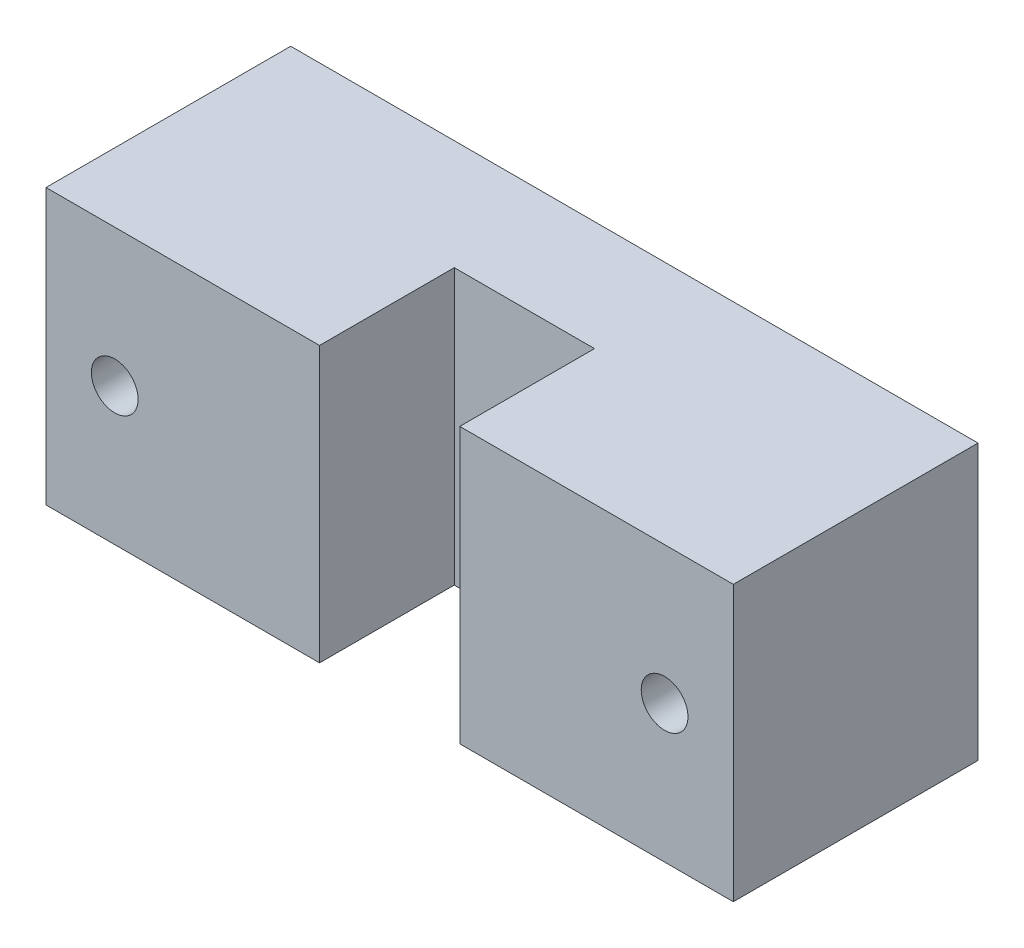
ISO-10303-21;
HEADER;
FILE_DESCRIPTION(('STEP AP214'),'2;1');
FILE_NAME('part.step','',(''),(''),'','','');
FILE_SCHEMA(('AUTOMOTIVE_DESIGN { 1 0 10303 214 1 1 1 1 }'));
ENDSEC;
DATA;
#1=APPLICATION_CONTEXT('core data for automotive mechanical design processes');
#2=APPLICATION_PROTOCOL_DEFINITION('international standard','automotive_design',2000,#1);
#3=PRODUCT_CONTEXT('',#1,'mechanical');
#4=PRODUCT('Part','Part','',(#3));
#5=PRODUCT_RELATED_PRODUCT_CATEGORY('part','',(#4));
#6=PRODUCT_DEFINITION_FORMATION('','',#4);
#7=PRODUCT_DEFINITION_CONTEXT('part definition',#1,'design');
#8=PRODUCT_DEFINITION('design','',#6,#7);
#9=PRODUCT_DEFINITION_SHAPE('','',#8);
#10=(LENGTH_UNIT() NAMED_UNIT(*) SI_UNIT(.MILLI.,.METRE.));
#11=(NAMED_UNIT(*) PLANE_ANGLE_UNIT() SI_UNIT($,.RADIAN.));
#12=(NAMED_UNIT(*) SI_UNIT($,.STERADIAN.) SOLID_ANGLE_UNIT());
#13=UNCERTAINTY_MEASURE_WITH_UNIT(LENGTH_MEASURE(1.E-05),#10,'distance_accuracy_value','');
#14=(GEOMETRIC_REPRESENTATION_CONTEXT(3) GLOBAL_UNCERTAINTY_ASSIGNED_CONTEXT((#13)) GLOBAL_UNIT_ASSIGNED_CONTEXT((#10,
#11,#12)) REPRESENTATION_CONTEXT('',''));
#15=CARTESIAN_POINT('',(0.,0.,0.));
#16=DIRECTION('',(0.,0.,1.));
#17=DIRECTION('',(1.,0.,0.));
#18=AXIS2_PLACEMENT_3D('',#15,#16,#17);
#19=CARTESIAN_POINT('',(0.,0.,8.));
#20=DIRECTION('',(0.,0.,1.));
#21=DIRECTION('',(1.,0.,0.));
#22=AXIS2_PLACEMENT_3D('',#19,#20,#21);
#23=PLANE('',#22);
#24=DIRECTION('',(0.,-1.,0.));
#25=VECTOR('',#24,1.);
#26=CARTESIAN_POINT('',(-5.1,63.0739107283418,8.));
#27=LINE('',#26,#25);
#28=CARTESIAN_POINT('',(-5.1,10.,8.));
#29=VERTEX_POINT('',#28);
#30=CARTESIAN_POINT('',(-5.1,-9.99999999999999,8.));
#31=VERTEX_POINT('',#30);
#32=EDGE_CURVE('E61',#29,#31,#27,.T.);
#33=ORIENTED_EDGE('',*,*,#32,.T.);
#34=DIRECTION('',(1.,0.,0.));
#35=VECTOR('',#34,1.);
#36=CARTESIAN_POINT('',(25.,-9.99999999999999,8.));
#37=LINE('',#36,#35);
#38=CARTESIAN_POINT('',(5.1,-9.99999999999999,8.));
#39=VERTEX_POINT('',#38);
#40=EDGE_CURVE('E56',#31,#39,#37,.T.);
#41=ORIENTED_EDGE('',*,*,#40,.T.);
#42=DIRECTION('',(0.,-1.,0.));
#43=VECTOR('',#42,1.);
#44=CARTESIAN_POINT('',(5.1,63.0739107283418,8.));
#45=LINE('',#44,#43);
#46=CARTESIAN_POINT('',(5.1,10.,8.));
#47=VERTEX_POINT('',#46);
#48=EDGE_CURVE('E149',#47,#39,#45,.T.);
#49=ORIENTED_EDGE('',*,*,#48,.F.);
#50=DIRECTION('',(-1.,0.,0.));
#51=VECTOR('',#50,1.);
#52=CARTESIAN_POINT('',(25.,10.,8.));
#53=LINE('',#52,#51);
#54=EDGE_CURVE('E153',#47,#29,#53,.T.);
#55=ORIENTED_EDGE('',*,*,#54,.T.);
#56=EDGE_LOOP('',(#33,#41,#49,#55));
#57=FACE_BOUND('',#56,.T.);
#58=ADVANCED_FACE('F39',(#57),#23,.T.);
#59=CARTESIAN_POINT('',(0.,0.,0.));
#60=DIRECTION('',(0.,0.,1.));
#61=DIRECTION('',(1.,0.,0.));
#62=AXIS2_PLACEMENT_3D('',#59,#60,#61);
#63=PLANE('',#62);
#64=CARTESIAN_POINT('',(20.,0.,0.));
#65=DIRECTION('',(0.,0.,-1.));
#66=DIRECTION('',(-1.,0.,0.));
#67=AXIS2_PLACEMENT_3D('',#64,#65,#66);
#68=CIRCLE('',#67,3.75);
#69=CARTESIAN_POINT('',(16.25,0.,0.));
#70=VERTEX_POINT('',#69);
#71=EDGE_CURVE('E192',#70,#70,#68,.T.);
#72=ORIENTED_EDGE('',*,*,#71,.F.);
#73=EDGE_LOOP('',(#72));
#74=FACE_BOUND('',#73,.T.);
#75=CARTESIAN_POINT('',(-20.,0.,0.));
#76=DIRECTION('',(0.,0.,-1.));
#77=DIRECTION('',(-1.,0.,0.));
#78=AXIS2_PLACEMENT_3D('',#75,#76,#77);
#79=CIRCLE('',#78,3.75);
#80=CARTESIAN_POINT('',(-23.75,0.,0.));
#81=VERTEX_POINT('',#80);
#82=EDGE_CURVE('E187',#81,#81,#79,.T.);
#83=ORIENTED_EDGE('',*,*,#82,.F.);
#84=EDGE_LOOP('',(#83));
#85=FACE_BOUND('',#84,.T.);
#86=DIRECTION('',(0.,-1.,0.));
#87=VECTOR('',#86,1.);
#88=CARTESIAN_POINT('',(-25.,-9.99999999999999,0.));
#89=LINE('',#88,#87);
#90=CARTESIAN_POINT('',(-25.,10.,0.));
#91=VERTEX_POINT('',#90);
#92=CARTESIAN_POINT('',(-25.,-9.99999999999999,0.));
#93=VERTEX_POINT('',#92);
#94=EDGE_CURVE('E157',#91,#93,#89,.T.);
#95=ORIENTED_EDGE('',*,*,#94,.F.);
#96=DIRECTION('',(-1.,0.,0.));
#97=VECTOR('',#96,1.);
#98=CARTESIAN_POINT('',(25.,10.,0.));
#99=LINE('',#98,#97);
#100=CARTESIAN_POINT('',(25.,10.,0.));
#101=VERTEX_POINT('',#100);
#102=EDGE_CURVE('E154',#101,#91,#99,.T.);
#103=ORIENTED_EDGE('',*,*,#102,.F.);
#104=DIRECTION('',(0.,1.,0.));
#105=VECTOR('',#104,1.);
#106=CARTESIAN_POINT('',(25.,-9.99999999999999,0.));
#107=LINE('',#106,#105);
#108=CARTESIAN_POINT('',(25.,-9.99999999999999,0.));
#109=VERTEX_POINT('',#108);
#110=EDGE_CURVE('E161',#109,#101,#107,.T.);
#111=ORIENTED_EDGE('',*,*,#110,.F.);
#112=DIRECTION('',(1.,0.,0.));
#113=VECTOR('',#112,1.);
#114=CARTESIAN_POINT('',(25.,-9.99999999999999,0.));
#115=LINE('',#114,#113);
#116=EDGE_CURVE('E109',#93,#109,#115,.T.);
#117=ORIENTED_EDGE('',*,*,#116,.F.);
#118=EDGE_LOOP('',(#95,#103,#111,#117));
#119=FACE_BOUND('',#118,.T.);
#120=ADVANCED_FACE('F171',(#74,#85,#119),#63,.F.);
#121=CARTESIAN_POINT('',(-25.,-9.99999999999999,8.));
#122=DIRECTION('',(1.,0.,0.));
#123=DIRECTION('',(0.,1.,0.));
#124=AXIS2_PLACEMENT_3D('',#121,#122,#123);
#125=PLANE('',#124);
#126=ORIENTED_EDGE('',*,*,#94,.T.);
#127=DIRECTION('',(0.,0.,-1.));
#128=VECTOR('',#127,1.);
#129=CARTESIAN_POINT('',(-25.,-9.99999999999999,8.));
#130=LINE('',#129,#128);
#131=CARTESIAN_POINT('',(-25.,-9.99999999999999,17.8));
#132=VERTEX_POINT('',#131);
#133=EDGE_CURVE('E11',#132,#93,#130,.T.);
#134=ORIENTED_EDGE('',*,*,#133,.F.);
#135=DIRECTION('',(0.,-1.,0.));
#136=VECTOR('',#135,1.);
#137=CARTESIAN_POINT('',(-25.,63.0739107283418,17.8));
#138=LINE('',#137,#136);
#139=CARTESIAN_POINT('',(-25.,10.,17.8));
#140=VERTEX_POINT('',#139);
#141=EDGE_CURVE('E142',#140,#132,#138,.T.);
#142=ORIENTED_EDGE('',*,*,#141,.F.);
#143=DIRECTION('',(0.,0.,-1.));
#144=VECTOR('',#143,1.);
#145=CARTESIAN_POINT('',(-25.,10.,8.));
#146=LINE('',#145,#144);
#147=EDGE_CURVE('E156',#140,#91,#146,.T.);
#148=ORIENTED_EDGE('',*,*,#147,.T.);
#149=EDGE_LOOP('',(#126,#134,#142,#148));
#150=FACE_BOUND('',#149,.T.);
#151=ADVANCED_FACE('F41',(#150),#125,.F.);
#152=CARTESIAN_POINT('',(25.,-9.99999999999999,8.));
#153=DIRECTION('',(0.,1.,0.));
#154=DIRECTION('',(-1.,0.,0.));
#155=AXIS2_PLACEMENT_3D('',#152,#153,#154);
#156=PLANE('',#155);
#157=ORIENTED_EDGE('',*,*,#116,.T.);
#158=DIRECTION('',(0.,0.,-1.));
#159=VECTOR('',#158,1.);
#160=CARTESIAN_POINT('',(25.,-9.99999999999999,8.));
#161=LINE('',#160,#159);
#162=CARTESIAN_POINT('',(25.,-9.99999999999999,17.8));
#163=VERTEX_POINT('',#162);
#164=EDGE_CURVE('E48',#163,#109,#161,.T.);
#165=ORIENTED_EDGE('',*,*,#164,.F.);
#166=DIRECTION('',(-1.,0.,0.));
#167=VECTOR('',#166,1.);
#168=CARTESIAN_POINT('',(5.1,-9.99999999999999,17.8));
#169=LINE('',#168,#167);
#170=CARTESIAN_POINT('',(5.1,-9.99999999999999,17.8));
#171=VERTEX_POINT('',#170);
#172=EDGE_CURVE('E108',#163,#171,#169,.T.);
#173=ORIENTED_EDGE('',*,*,#172,.T.);
#174=DIRECTION('',(0.,0.,-1.));
#175=VECTOR('',#174,1.);
#176=CARTESIAN_POINT('',(5.1,-9.99999999999999,8.));
#177=LINE('',#176,#175);
#178=EDGE_CURVE('E127',#171,#39,#177,.T.);
#179=ORIENTED_EDGE('',*,*,#178,.T.);
#180=ORIENTED_EDGE('',*,*,#40,.F.);
#181=DIRECTION('',(0.,0.,1.));
#182=VECTOR('',#181,1.);
#183=CARTESIAN_POINT('',(-5.1,-9.99999999999999,17.8));
#184=LINE('',#183,#182);
#185=CARTESIAN_POINT('',(-5.1,-9.99999999999999,17.8));
#186=VERTEX_POINT('',#185);
#187=EDGE_CURVE('E130',#31,#186,#184,.T.);
#188=ORIENTED_EDGE('',*,*,#187,.T.);
#189=DIRECTION('',(-1.,0.,0.));
#190=VECTOR('',#189,1.);
#191=CARTESIAN_POINT('',(-25.,-9.99999999999999,17.8));
#192=LINE('',#191,#190);
#193=EDGE_CURVE('E122',#186,#132,#192,.T.);
#194=ORIENTED_EDGE('',*,*,#193,.T.);
#195=ORIENTED_EDGE('',*,*,#133,.T.);
#196=EDGE_LOOP('',(#157,#165,#173,#179,#180,#188,#194,#195));
#197=FACE_BOUND('',#196,.T.);
#198=ADVANCED_FACE('F105',(#197),#156,.F.);
#199=CARTESIAN_POINT('',(25.,-9.99999999999999,8.));
#200=DIRECTION('',(-1.,0.,0.));
#201=DIRECTION('',(0.,-1.,0.));
#202=AXIS2_PLACEMENT_3D('',#199,#200,#201);
#203=PLANE('',#202);
#204=ORIENTED_EDGE('',*,*,#110,.T.);
#205=DIRECTION('',(0.,0.,-1.));
#206=VECTOR('',#205,1.);
#207=CARTESIAN_POINT('',(25.,10.,8.));
#208=LINE('',#207,#206);
#209=CARTESIAN_POINT('',(25.,10.,17.8));
#210=VERTEX_POINT('',#209);
#211=EDGE_CURVE('E112',#210,#101,#208,.T.);
#212=ORIENTED_EDGE('',*,*,#211,.F.);
#213=DIRECTION('',(0.,-1.,0.));
#214=VECTOR('',#213,1.);
#215=CARTESIAN_POINT('',(25.,63.0739107283418,17.8));
#216=LINE('',#215,#214);
#217=EDGE_CURVE('E115',#210,#163,#216,.T.);
#218=ORIENTED_EDGE('',*,*,#217,.T.);
#219=ORIENTED_EDGE('',*,*,#164,.T.);
#220=EDGE_LOOP('',(#204,#212,#218,#219));
#221=FACE_BOUND('',#220,.T.);
#222=ADVANCED_FACE('F116',(#221),#203,.F.);
#223=CARTESIAN_POINT('',(25.,10.,8.));
#224=DIRECTION('',(0.,-1.,0.));
#225=DIRECTION('',(1.,0.,0.));
#226=AXIS2_PLACEMENT_3D('',#223,#224,#225);
#227=PLANE('',#226);
#228=ORIENTED_EDGE('',*,*,#102,.T.);
#229=ORIENTED_EDGE('',*,*,#147,.F.);
#230=DIRECTION('',(1.,0.,0.));
#231=VECTOR('',#230,1.);
#232=CARTESIAN_POINT('',(-25.,10.,17.8));
#233=LINE('',#232,#231);
#234=CARTESIAN_POINT('',(-5.1,10.,17.8));
#235=VERTEX_POINT('',#234);
#236=EDGE_CURVE('E135',#140,#235,#233,.T.);
#237=ORIENTED_EDGE('',*,*,#236,.T.);
#238=DIRECTION('',(0.,0.,-1.));
#239=VECTOR('',#238,1.);
#240=CARTESIAN_POINT('',(-5.1,10.,17.8));
#241=LINE('',#240,#239);
#242=EDGE_CURVE('E181',#235,#29,#241,.T.);
#243=ORIENTED_EDGE('',*,*,#242,.T.);
#244=ORIENTED_EDGE('',*,*,#54,.F.);
#245=DIRECTION('',(0.,0.,1.));
#246=VECTOR('',#245,1.);
#247=CARTESIAN_POINT('',(5.1,10.,8.));
#248=LINE('',#247,#246);
#249=CARTESIAN_POINT('',(5.09999999999999,10.,17.8));
#250=VERTEX_POINT('',#249);
#251=EDGE_CURVE('E182',#47,#250,#248,.T.);
#252=ORIENTED_EDGE('',*,*,#251,.T.);
#253=DIRECTION('',(1.,0.,0.));
#254=VECTOR('',#253,1.);
#255=CARTESIAN_POINT('',(5.1,10.,17.8));
#256=LINE('',#255,#254);
#257=EDGE_CURVE('E145',#250,#210,#256,.T.);
#258=ORIENTED_EDGE('',*,*,#257,.T.);
#259=ORIENTED_EDGE('',*,*,#211,.T.);
#260=EDGE_LOOP('',(#228,#229,#237,#243,#244,#252,#258,#259));
#261=FACE_BOUND('',#260,.T.);
#262=ADVANCED_FACE('F168',(#261),#227,.F.);
#263=CARTESIAN_POINT('',(5.09999999999999,63.0739107283418,17.8));
#264=DIRECTION('',(0.,0.,1.));
#265=DIRECTION('',(1.,0.,0.));
#266=AXIS2_PLACEMENT_3D('',#263,#264,#265);
#267=PLANE('',#266);
#268=CARTESIAN_POINT('',(20.,0.,17.8));
#269=DIRECTION('',(0.,0.,-1.));
#270=DIRECTION('',(-1.,0.,0.));
#271=AXIS2_PLACEMENT_3D('',#268,#269,#270);
#272=CIRCLE('',#271,1.7);
#273=CARTESIAN_POINT('',(18.3,0.,17.8));
#274=VERTEX_POINT('',#273);
#275=EDGE_CURVE('E201',#274,#274,#272,.T.);
#276=ORIENTED_EDGE('',*,*,#275,.T.);
#277=EDGE_LOOP('',(#276));
#278=FACE_BOUND('',#277,.T.);
#279=ORIENTED_EDGE('',*,*,#257,.F.);
#280=DIRECTION('',(0.,-1.,0.));
#281=VECTOR('',#280,1.);
#282=CARTESIAN_POINT('',(5.09999999999999,63.0739107283418,17.8));
#283=LINE('',#282,#281);
#284=EDGE_CURVE('E121',#250,#171,#283,.T.);
#285=ORIENTED_EDGE('',*,*,#284,.T.);
#286=ORIENTED_EDGE('',*,*,#172,.F.);
#287=ORIENTED_EDGE('',*,*,#217,.F.);
#288=EDGE_LOOP('',(#279,#285,#286,#287));
#289=FACE_BOUND('',#288,.T.);
#290=ADVANCED_FACE('F124',(#278,#289),#267,.T.);
#291=CARTESIAN_POINT('',(5.1,63.0739107283418,8.));
#292=DIRECTION('',(-1.,0.,0.));
#293=DIRECTION('',(0.,0.,1.));
#294=AXIS2_PLACEMENT_3D('',#291,#292,#293);
#295=PLANE('',#294);
#296=ORIENTED_EDGE('',*,*,#251,.F.);
#297=ORIENTED_EDGE('',*,*,#48,.T.);
#298=ORIENTED_EDGE('',*,*,#178,.F.);
#299=ORIENTED_EDGE('',*,*,#284,.F.);
#300=EDGE_LOOP('',(#296,#297,#298,#299));
#301=FACE_BOUND('',#300,.T.);
#302=ADVANCED_FACE('F298',(#301),#295,.T.);
#303=CARTESIAN_POINT('',(-25.,63.0739107283418,17.8));
#304=DIRECTION('',(0.,0.,1.));
#305=DIRECTION('',(1.,0.,0.));
#306=AXIS2_PLACEMENT_3D('',#303,#304,#305);
#307=PLANE('',#306);
#308=CARTESIAN_POINT('',(-20.,0.,17.8));
#309=DIRECTION('',(0.,0.,-1.));
#310=DIRECTION('',(-1.,0.,0.));
#311=AXIS2_PLACEMENT_3D('',#308,#309,#310);
#312=CIRCLE('',#311,1.7);
#313=CARTESIAN_POINT('',(-21.7,0.,17.8));
#314=VERTEX_POINT('',#313);
#315=EDGE_CURVE('E196',#314,#314,#312,.T.);
#316=ORIENTED_EDGE('',*,*,#315,.T.);
#317=EDGE_LOOP('',(#316));
#318=FACE_BOUND('',#317,.T.);
#319=ORIENTED_EDGE('',*,*,#236,.F.);
#320=ORIENTED_EDGE('',*,*,#141,.T.);
#321=ORIENTED_EDGE('',*,*,#193,.F.);
#322=DIRECTION('',(0.,-1.,0.));
#323=VECTOR('',#322,1.);
#324=CARTESIAN_POINT('',(-5.1,63.0739107283418,17.8));
#325=LINE('',#324,#323);
#326=EDGE_CURVE('E146',#235,#186,#325,.T.);
#327=ORIENTED_EDGE('',*,*,#326,.F.);
#328=EDGE_LOOP('',(#319,#320,#321,#327));
#329=FACE_BOUND('',#328,.T.);
#330=ADVANCED_FACE('F179',(#318,#329),#307,.T.);
#331=CARTESIAN_POINT('',(-5.1,63.0739107283418,17.8));
#332=DIRECTION('',(1.,0.,0.));
#333=DIRECTION('',(0.,0.,-1.));
#334=AXIS2_PLACEMENT_3D('',#331,#332,#333);
#335=PLANE('',#334);
#336=ORIENTED_EDGE('',*,*,#242,.F.);
#337=ORIENTED_EDGE('',*,*,#326,.T.);
#338=ORIENTED_EDGE('',*,*,#187,.F.);
#339=ORIENTED_EDGE('',*,*,#32,.F.);
#340=EDGE_LOOP('',(#336,#337,#338,#339));
#341=FACE_BOUND('',#340,.T.);
#342=ADVANCED_FACE('F251',(#341),#335,.T.);
#343=CARTESIAN_POINT('',(-20.,0.,4.));
#344=DIRECTION('',(0.,0.,-1.));
#345=DIRECTION('',(-1.,0.,0.));
#346=AXIS2_PLACEMENT_3D('',#343,#344,#345);
#347=CYLINDRICAL_SURFACE('',#346,3.75);
#348=CARTESIAN_POINT('',(-20.,0.,4.));
#349=DIRECTION('',(0.,0.,-1.));
#350=DIRECTION('',(-1.,0.,0.));
#351=AXIS2_PLACEMENT_3D('',#348,#349,#350);
#352=CIRCLE('',#351,3.75);
#353=CARTESIAN_POINT('',(-23.75,0.,4.));
#354=VERTEX_POINT('',#353);
#355=EDGE_CURVE('E133',#354,#354,#352,.T.);
#356=ORIENTED_EDGE('',*,*,#355,.F.);
#357=EDGE_LOOP('',(#356));
#358=FACE_BOUND('',#357,.T.);
#359=ORIENTED_EDGE('',*,*,#82,.T.);
#360=EDGE_LOOP('',(#359));
#361=FACE_BOUND('',#360,.T.);
#362=ADVANCED_FACE('F256',(#358,#361),#347,.F.);
#363=CARTESIAN_POINT('',(-20.,0.,4.));
#364=DIRECTION('',(0.,0.,-1.));
#365=DIRECTION('',(-1.,0.,0.));
#366=AXIS2_PLACEMENT_3D('',#363,#364,#365);
#367=PLANE('',#366);
#368=CARTESIAN_POINT('',(-20.,0.,4.));
#369=DIRECTION('',(0.,0.,-1.));
#370=DIRECTION('',(-1.,0.,0.));
#371=AXIS2_PLACEMENT_3D('',#368,#369,#370);
#372=CIRCLE('',#371,1.7);
#373=CARTESIAN_POINT('',(-21.7,0.,4.));
#374=VERTEX_POINT('',#373);
#375=EDGE_CURVE('E128',#374,#374,#372,.T.);
#376=ORIENTED_EDGE('',*,*,#375,.F.);
#377=EDGE_LOOP('',(#376));
#378=FACE_BOUND('',#377,.T.);
#379=ORIENTED_EDGE('',*,*,#355,.T.);
#380=EDGE_LOOP('',(#379));
#381=FACE_BOUND('',#380,.T.);
#382=ADVANCED_FACE('F261',(#378,#381),#367,.T.);
#383=CARTESIAN_POINT('',(-20.,0.,8.));
#384=DIRECTION('',(0.,0.,-1.));
#385=DIRECTION('',(-1.,0.,0.));
#386=AXIS2_PLACEMENT_3D('',#383,#384,#385);
#387=CYLINDRICAL_SURFACE('',#386,1.7);
#388=ORIENTED_EDGE('',*,*,#375,.T.);
#389=EDGE_LOOP('',(#388));
#390=FACE_BOUND('',#389,.T.);
#391=ORIENTED_EDGE('',*,*,#315,.F.);
#392=EDGE_LOOP('',(#391));
#393=FACE_BOUND('',#392,.T.);
#394=ADVANCED_FACE('F227',(#390,#393),#387,.F.);
#395=CARTESIAN_POINT('',(20.,0.,4.));
#396=DIRECTION('',(0.,0.,-1.));
#397=DIRECTION('',(-1.,0.,0.));
#398=AXIS2_PLACEMENT_3D('',#395,#396,#397);
#399=CYLINDRICAL_SURFACE('',#398,3.75);
#400=CARTESIAN_POINT('',(20.,0.,4.));
#401=DIRECTION('',(0.,0.,-1.));
#402=DIRECTION('',(-1.,0.,0.));
#403=AXIS2_PLACEMENT_3D('',#400,#401,#402);
#404=CIRCLE('',#403,3.75);
#405=CARTESIAN_POINT('',(16.25,0.,4.));
#406=VERTEX_POINT('',#405);
#407=EDGE_CURVE('E195',#406,#406,#404,.T.);
#408=ORIENTED_EDGE('',*,*,#407,.F.);
#409=EDGE_LOOP('',(#408));
#410=FACE_BOUND('',#409,.T.);
#411=ORIENTED_EDGE('',*,*,#71,.T.);
#412=EDGE_LOOP('',(#411));
#413=FACE_BOUND('',#412,.T.);
#414=ADVANCED_FACE('F214',(#410,#413),#399,.F.);
#415=CARTESIAN_POINT('',(20.,0.,4.));
#416=DIRECTION('',(0.,0.,-1.));
#417=DIRECTION('',(-1.,0.,0.));
#418=AXIS2_PLACEMENT_3D('',#415,#416,#417);
#419=PLANE('',#418);
#420=CARTESIAN_POINT('',(20.,0.,4.));
#421=DIRECTION('',(0.,0.,-1.));
#422=DIRECTION('',(-1.,0.,0.));
#423=AXIS2_PLACEMENT_3D('',#420,#421,#422);
#424=CIRCLE('',#423,1.7);
#425=CARTESIAN_POINT('',(18.3,0.,4.));
#426=VERTEX_POINT('',#425);
#427=EDGE_CURVE('E43',#426,#426,#424,.T.);
#428=ORIENTED_EDGE('',*,*,#427,.F.);
#429=EDGE_LOOP('',(#428));
#430=FACE_BOUND('',#429,.T.);
#431=ORIENTED_EDGE('',*,*,#407,.T.);
#432=EDGE_LOOP('',(#431));
#433=FACE_BOUND('',#432,.T.);
#434=ADVANCED_FACE('F208',(#430,#433),#419,.T.);
#435=CARTESIAN_POINT('',(20.,0.,8.));
#436=DIRECTION('',(0.,0.,-1.));
#437=DIRECTION('',(-1.,0.,0.));
#438=AXIS2_PLACEMENT_3D('',#435,#436,#437);
#439=CYLINDRICAL_SURFACE('',#438,1.7);
#440=ORIENTED_EDGE('',*,*,#427,.T.);
#441=EDGE_LOOP('',(#440));
#442=FACE_BOUND('',#441,.T.);
#443=ORIENTED_EDGE('',*,*,#275,.F.);
#444=EDGE_LOOP('',(#443));
#445=FACE_BOUND('',#444,.T.);
#446=ADVANCED_FACE('F206',(#442,#445),#439,.F.);
#447=CLOSED_SHELL('',(#58,#120,#151,#198,#222,#262,#290,#302,#330,#342,#362,#382,#394,#414,#434,#446));
#448=MANIFOLD_SOLID_BREP('B2',#447);
#449=ADVANCED_BREP_SHAPE_REPRESENTATION('',(#18,#448),#14);
#450=SHAPE_DEFINITION_REPRESENTATION(#9,#449);
ENDSEC;
END-ISO-10303-21;
